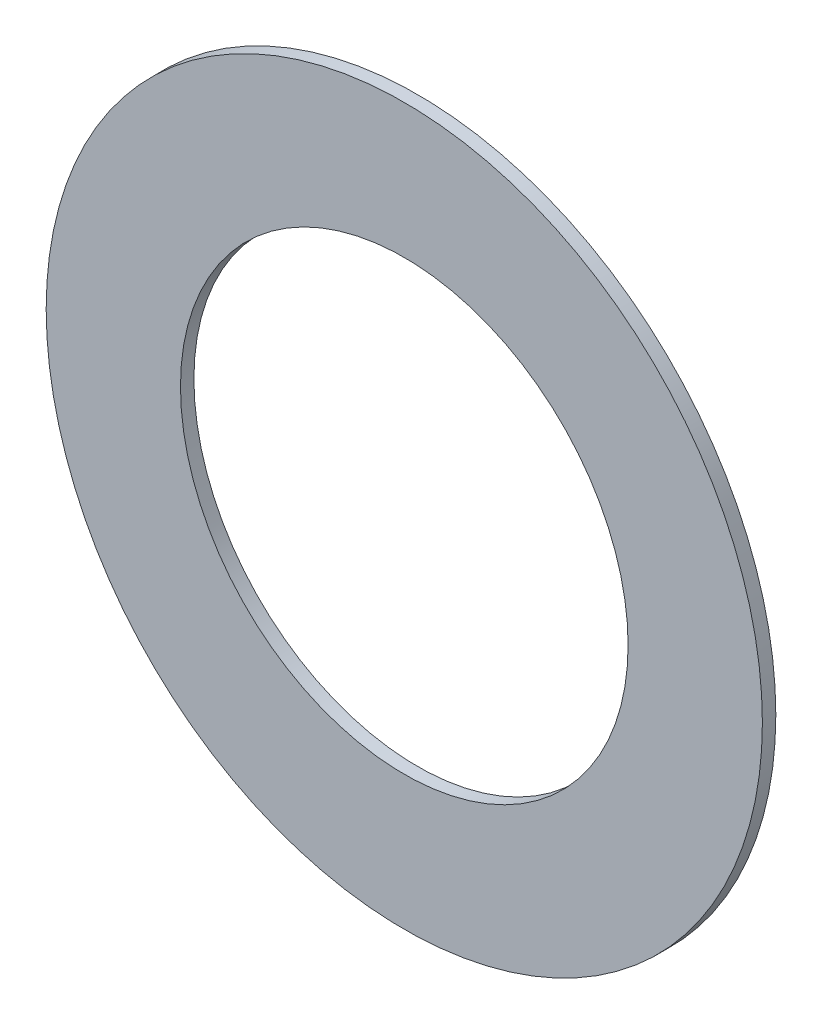
ISO-10303-21;
HEADER;
FILE_DESCRIPTION(('STEP AP214'),'2;1');
FILE_NAME('part.step','',(''),(''),'','','');
FILE_SCHEMA(('AUTOMOTIVE_DESIGN { 1 0 10303 214 1 1 1 1 }'));
ENDSEC;
DATA;
#1=APPLICATION_CONTEXT('core data for automotive mechanical design processes');
#2=APPLICATION_PROTOCOL_DEFINITION('international standard','automotive_design',2000,#1);
#3=PRODUCT_CONTEXT('',#1,'mechanical');
#4=PRODUCT('Part','Part','',(#3));
#5=PRODUCT_RELATED_PRODUCT_CATEGORY('part','',(#4));
#6=PRODUCT_DEFINITION_FORMATION('','',#4);
#7=PRODUCT_DEFINITION_CONTEXT('part definition',#1,'design');
#8=PRODUCT_DEFINITION('design','',#6,#7);
#9=PRODUCT_DEFINITION_SHAPE('','',#8);
#10=(LENGTH_UNIT() NAMED_UNIT(*) SI_UNIT(.MILLI.,.METRE.));
#11=(NAMED_UNIT(*) PLANE_ANGLE_UNIT() SI_UNIT($,.RADIAN.));
#12=(NAMED_UNIT(*) SI_UNIT($,.STERADIAN.) SOLID_ANGLE_UNIT());
#13=UNCERTAINTY_MEASURE_WITH_UNIT(LENGTH_MEASURE(1.E-05),#10,'distance_accuracy_value','');
#14=(GEOMETRIC_REPRESENTATION_CONTEXT(3) GLOBAL_UNCERTAINTY_ASSIGNED_CONTEXT((#13)) GLOBAL_UNIT_ASSIGNED_CONTEXT((#10,
#11,#12)) REPRESENTATION_CONTEXT('',''));
#15=CARTESIAN_POINT('',(0.,0.,0.));
#16=DIRECTION('',(0.,0.,1.));
#17=DIRECTION('',(1.,0.,0.));
#18=AXIS2_PLACEMENT_3D('',#15,#16,#17);
#19=CARTESIAN_POINT('',(0.,0.,0.3));
#20=DIRECTION('',(0.,0.,1.));
#21=DIRECTION('',(1.,0.,0.));
#22=AXIS2_PLACEMENT_3D('',#19,#20,#21);
#23=PLANE('',#22);
#24=CARTESIAN_POINT('',(0.,0.,0.3));
#25=DIRECTION('',(0.,0.,1.));
#26=DIRECTION('',(1.,0.,0.));
#27=AXIS2_PLACEMENT_3D('',#24,#25,#26);
#28=CIRCLE('',#27,8.);
#29=CARTESIAN_POINT('',(8.,0.,0.3));
#30=VERTEX_POINT('',#29);
#31=EDGE_CURVE('E10',#30,#30,#28,.T.);
#32=ORIENTED_EDGE('',*,*,#31,.T.);
#33=EDGE_LOOP('',(#32));
#34=FACE_BOUND('',#33,.T.);
#35=CARTESIAN_POINT('',(0.,0.,0.3));
#36=DIRECTION('',(0.,0.,1.));
#37=DIRECTION('',(1.,0.,0.));
#38=AXIS2_PLACEMENT_3D('',#35,#36,#37);
#39=CIRCLE('',#38,5.);
#40=CARTESIAN_POINT('',(5.,0.,0.3));
#41=VERTEX_POINT('',#40);
#42=EDGE_CURVE('E42',#41,#41,#39,.T.);
#43=ORIENTED_EDGE('',*,*,#42,.F.);
#44=EDGE_LOOP('',(#43));
#45=FACE_BOUND('',#44,.T.);
#46=ADVANCED_FACE('F31',(#34,#45),#23,.T.);
#47=CARTESIAN_POINT('',(0.,0.,0.));
#48=DIRECTION('',(0.,0.,1.));
#49=DIRECTION('',(1.,0.,0.));
#50=AXIS2_PLACEMENT_3D('',#47,#48,#49);
#51=PLANE('',#50);
#52=CARTESIAN_POINT('',(0.,0.,0.));
#53=DIRECTION('',(0.,0.,1.));
#54=DIRECTION('',(1.,0.,0.));
#55=AXIS2_PLACEMENT_3D('',#52,#53,#54);
#56=CIRCLE('',#55,8.);
#57=CARTESIAN_POINT('',(8.,0.,0.));
#58=VERTEX_POINT('',#57);
#59=EDGE_CURVE('E35',#58,#58,#56,.T.);
#60=ORIENTED_EDGE('',*,*,#59,.F.);
#61=EDGE_LOOP('',(#60));
#62=FACE_BOUND('',#61,.T.);
#63=CARTESIAN_POINT('',(0.,0.,0.));
#64=DIRECTION('',(0.,0.,1.));
#65=DIRECTION('',(1.,0.,0.));
#66=AXIS2_PLACEMENT_3D('',#63,#64,#65);
#67=CIRCLE('',#66,5.);
#68=CARTESIAN_POINT('',(5.,0.,0.));
#69=VERTEX_POINT('',#68);
#70=EDGE_CURVE('E44',#69,#69,#67,.T.);
#71=ORIENTED_EDGE('',*,*,#70,.T.);
#72=EDGE_LOOP('',(#71));
#73=FACE_BOUND('',#72,.T.);
#74=ADVANCED_FACE('F54',(#62,#73),#51,.F.);
#75=CARTESIAN_POINT('',(0.,0.,0.3));
#76=DIRECTION('',(0.,0.,-1.));
#77=DIRECTION('',(-1.,0.,0.));
#78=AXIS2_PLACEMENT_3D('',#75,#76,#77);
#79=CYLINDRICAL_SURFACE('',#78,8.);
#80=ORIENTED_EDGE('',*,*,#31,.F.);
#81=EDGE_LOOP('',(#80));
#82=FACE_BOUND('',#81,.T.);
#83=ORIENTED_EDGE('',*,*,#59,.T.);
#84=EDGE_LOOP('',(#83));
#85=FACE_BOUND('',#84,.T.);
#86=ADVANCED_FACE('F33',(#82,#85),#79,.T.);
#87=CARTESIAN_POINT('',(0.,0.,0.3));
#88=DIRECTION('',(0.,0.,-1.));
#89=DIRECTION('',(-1.,0.,0.));
#90=AXIS2_PLACEMENT_3D('',#87,#88,#89);
#91=CYLINDRICAL_SURFACE('',#90,5.);
#92=ORIENTED_EDGE('',*,*,#42,.T.);
#93=EDGE_LOOP('',(#92));
#94=FACE_BOUND('',#93,.T.);
#95=ORIENTED_EDGE('',*,*,#70,.F.);
#96=EDGE_LOOP('',(#95));
#97=FACE_BOUND('',#96,.T.);
#98=ADVANCED_FACE('F50',(#94,#97),#91,.F.);
#99=CLOSED_SHELL('',(#46,#74,#86,#98));
#100=MANIFOLD_SOLID_BREP('B2',#99);
#101=ADVANCED_BREP_SHAPE_REPRESENTATION('',(#18,#100),#14);
#102=SHAPE_DEFINITION_REPRESENTATION(#9,#101);
ENDSEC;
END-ISO-10303-21;
